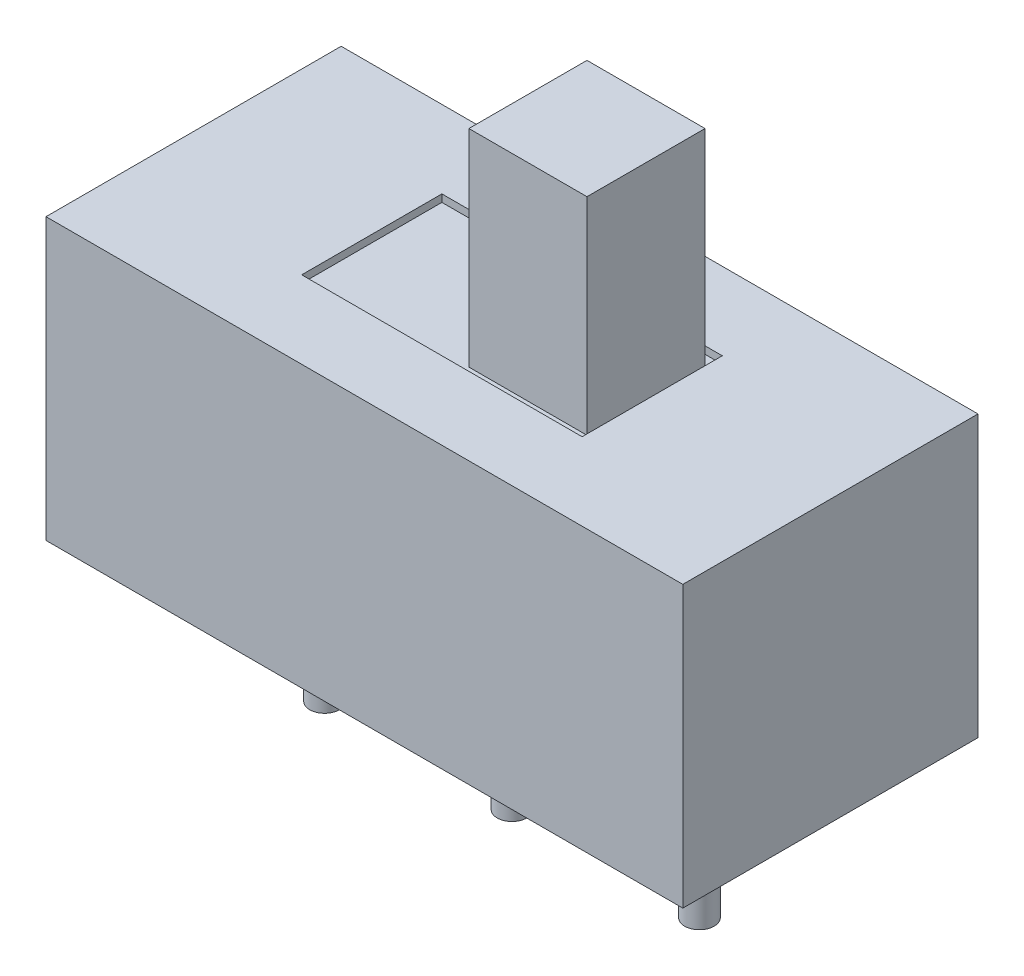
ISO-10303-21;
HEADER;
FILE_DESCRIPTION(('STEP AP214'),'2;1');
FILE_NAME('part.step','',(''),(''),'','','');
FILE_SCHEMA(('AUTOMOTIVE_DESIGN { 1 0 10303 214 1 1 1 1 }'));
ENDSEC;
DATA;
#1=APPLICATION_CONTEXT('core data for automotive mechanical design processes');
#2=APPLICATION_PROTOCOL_DEFINITION('international standard','automotive_design',2000,#1);
#3=PRODUCT_CONTEXT('',#1,'mechanical');
#4=PRODUCT('Part','Part','',(#3));
#5=PRODUCT_RELATED_PRODUCT_CATEGORY('part','',(#4));
#6=PRODUCT_DEFINITION_FORMATION('','',#4);
#7=PRODUCT_DEFINITION_CONTEXT('part definition',#1,'design');
#8=PRODUCT_DEFINITION('design','',#6,#7);
#9=PRODUCT_DEFINITION_SHAPE('','',#8);
#10=(LENGTH_UNIT() NAMED_UNIT(*) SI_UNIT(.MILLI.,.METRE.));
#11=(NAMED_UNIT(*) PLANE_ANGLE_UNIT() SI_UNIT($,.RADIAN.));
#12=(NAMED_UNIT(*) SI_UNIT($,.STERADIAN.) SOLID_ANGLE_UNIT());
#13=UNCERTAINTY_MEASURE_WITH_UNIT(LENGTH_MEASURE(1.E-05),#10,'distance_accuracy_value','');
#14=(GEOMETRIC_REPRESENTATION_CONTEXT(3) GLOBAL_UNCERTAINTY_ASSIGNED_CONTEXT((#13)) GLOBAL_UNIT_ASSIGNED_CONTEXT((#10,
#11,#12)) REPRESENTATION_CONTEXT('',''));
#15=CARTESIAN_POINT('',(0.,0.,0.));
#16=DIRECTION('',(0.,0.,1.));
#17=DIRECTION('',(1.,0.,0.));
#18=AXIS2_PLACEMENT_3D('',#15,#16,#17);
#19=CARTESIAN_POINT('',(0.,3.7,0.));
#20=DIRECTION('',(0.,1.,0.));
#21=DIRECTION('',(0.,0.,1.));
#22=AXIS2_PLACEMENT_3D('',#19,#20,#21);
#23=PLANE('',#22);
#24=DIRECTION('',(0.,0.,-1.));
#25=VECTOR('',#24,1.);
#26=CARTESIAN_POINT('',(1.9,3.7,-0.95));
#27=LINE('',#26,#25);
#28=CARTESIAN_POINT('',(1.9,3.7,0.95));
#29=VERTEX_POINT('',#28);
#30=CARTESIAN_POINT('',(1.9,3.7,-0.95));
#31=VERTEX_POINT('',#30);
#32=EDGE_CURVE('E152',#29,#31,#27,.T.);
#33=ORIENTED_EDGE('',*,*,#32,.T.);
#34=DIRECTION('',(-1.,0.,0.));
#35=VECTOR('',#34,1.);
#36=CARTESIAN_POINT('',(-1.9,3.7,-0.95));
#37=LINE('',#36,#35);
#38=CARTESIAN_POINT('',(-1.9,3.7,-0.95));
#39=VERTEX_POINT('',#38);
#40=EDGE_CURVE('E155',#31,#39,#37,.T.);
#41=ORIENTED_EDGE('',*,*,#40,.T.);
#42=DIRECTION('',(0.,0.,1.));
#43=VECTOR('',#42,1.);
#44=CARTESIAN_POINT('',(-1.9,3.7,-0.95));
#45=LINE('',#44,#43);
#46=CARTESIAN_POINT('',(-1.9,3.7,0.95));
#47=VERTEX_POINT('',#46);
#48=EDGE_CURVE('E159',#39,#47,#45,.T.);
#49=ORIENTED_EDGE('',*,*,#48,.T.);
#50=DIRECTION('',(1.,0.,0.));
#51=VECTOR('',#50,1.);
#52=CARTESIAN_POINT('',(-1.9,3.7,0.95));
#53=LINE('',#52,#51);
#54=EDGE_CURVE('E162',#47,#29,#53,.T.);
#55=ORIENTED_EDGE('',*,*,#54,.T.);
#56=EDGE_LOOP('',(#33,#41,#49,#55));
#57=FACE_BOUND('',#56,.T.);
#58=DIRECTION('',(1.,0.,0.));
#59=VECTOR('',#58,1.);
#60=CARTESIAN_POINT('',(0.215935250156145,3.7,0.8));
#61=LINE('',#60,#59);
#62=CARTESIAN_POINT('',(0.215935250156145,3.7,0.8));
#63=VERTEX_POINT('',#62);
#64=CARTESIAN_POINT('',(1.81593525015615,3.7,0.8));
#65=VERTEX_POINT('',#64);
#66=EDGE_CURVE('E48',#63,#65,#61,.T.);
#67=ORIENTED_EDGE('',*,*,#66,.F.);
#68=DIRECTION('',(0.,0.,1.));
#69=VECTOR('',#68,1.);
#70=CARTESIAN_POINT('',(0.215935250156145,3.7,-0.8));
#71=LINE('',#70,#69);
#72=CARTESIAN_POINT('',(0.215935250156145,3.7,-0.8));
#73=VERTEX_POINT('',#72);
#74=EDGE_CURVE('E143',#73,#63,#71,.T.);
#75=ORIENTED_EDGE('',*,*,#74,.F.);
#76=DIRECTION('',(1.,0.,0.));
#77=VECTOR('',#76,1.);
#78=CARTESIAN_POINT('',(0.215935250156145,3.7,-0.8));
#79=LINE('',#78,#77);
#80=CARTESIAN_POINT('',(1.81593525015614,3.7,-0.8));
#81=VERTEX_POINT('',#80);
#82=EDGE_CURVE('E140',#73,#81,#79,.T.);
#83=ORIENTED_EDGE('',*,*,#82,.T.);
#84=DIRECTION('',(0.,0.,1.));
#85=VECTOR('',#84,1.);
#86=CARTESIAN_POINT('',(1.81593525015614,3.7,-0.8));
#87=LINE('',#86,#85);
#88=EDGE_CURVE('E53',#81,#65,#87,.T.);
#89=ORIENTED_EDGE('',*,*,#88,.T.);
#90=EDGE_LOOP('',(#67,#75,#83,#89));
#91=FACE_BOUND('',#90,.T.);
#92=ADVANCED_FACE('F33',(#57,#91),#23,.T.);
#93=CARTESIAN_POINT('',(4.315,3.8,-2.));
#94=DIRECTION('',(-1.,0.,0.));
#95=DIRECTION('',(0.,0.,1.));
#96=AXIS2_PLACEMENT_3D('',#93,#94,#95);
#97=PLANE('',#96);
#98=DIRECTION('',(0.,0.,-1.));
#99=VECTOR('',#98,1.);
#100=CARTESIAN_POINT('',(4.315,0.,-2.));
#101=LINE('',#100,#99);
#102=CARTESIAN_POINT('',(4.315,0.,2.));
#103=VERTEX_POINT('',#102);
#104=CARTESIAN_POINT('',(4.315,0.,-2.));
#105=VERTEX_POINT('',#104);
#106=EDGE_CURVE('E175',#103,#105,#101,.T.);
#107=ORIENTED_EDGE('',*,*,#106,.T.);
#108=DIRECTION('',(0.,-1.,0.));
#109=VECTOR('',#108,1.);
#110=CARTESIAN_POINT('',(4.315,3.8,-2.));
#111=LINE('',#110,#109);
#112=CARTESIAN_POINT('',(4.315,3.8,-2.));
#113=VERTEX_POINT('',#112);
#114=EDGE_CURVE('E208',#113,#105,#111,.T.);
#115=ORIENTED_EDGE('',*,*,#114,.F.);
#116=DIRECTION('',(0.,0.,-1.));
#117=VECTOR('',#116,1.);
#118=CARTESIAN_POINT('',(4.315,3.8,-2.));
#119=LINE('',#118,#117);
#120=CARTESIAN_POINT('',(4.315,3.8,2.));
#121=VERTEX_POINT('',#120);
#122=EDGE_CURVE('E182',#121,#113,#119,.T.);
#123=ORIENTED_EDGE('',*,*,#122,.F.);
#124=DIRECTION('',(0.,-1.,0.));
#125=VECTOR('',#124,1.);
#126=CARTESIAN_POINT('',(4.315,3.8,2.));
#127=LINE('',#126,#125);
#128=EDGE_CURVE('E192',#121,#103,#127,.T.);
#129=ORIENTED_EDGE('',*,*,#128,.T.);
#130=EDGE_LOOP('',(#107,#115,#123,#129));
#131=FACE_BOUND('',#130,.T.);
#132=ADVANCED_FACE('F35',(#131),#97,.F.);
#133=CARTESIAN_POINT('',(-4.315,3.8,-2.));
#134=DIRECTION('',(0.,0.,1.));
#135=DIRECTION('',(1.,0.,0.));
#136=AXIS2_PLACEMENT_3D('',#133,#134,#135);
#137=PLANE('',#136);
#138=DIRECTION('',(-1.,0.,0.));
#139=VECTOR('',#138,1.);
#140=CARTESIAN_POINT('',(-4.315,0.,-2.));
#141=LINE('',#140,#139);
#142=CARTESIAN_POINT('',(-4.315,0.,-2.));
#143=VERTEX_POINT('',#142);
#144=EDGE_CURVE('E195',#105,#143,#141,.T.);
#145=ORIENTED_EDGE('',*,*,#144,.T.);
#146=DIRECTION('',(0.,-1.,0.));
#147=VECTOR('',#146,1.);
#148=CARTESIAN_POINT('',(-4.315,3.8,-2.));
#149=LINE('',#148,#147);
#150=CARTESIAN_POINT('',(-4.315,3.8,-2.));
#151=VERTEX_POINT('',#150);
#152=EDGE_CURVE('E205',#151,#143,#149,.T.);
#153=ORIENTED_EDGE('',*,*,#152,.F.);
#154=DIRECTION('',(-1.,0.,0.));
#155=VECTOR('',#154,1.);
#156=CARTESIAN_POINT('',(-4.315,3.8,-2.));
#157=LINE('',#156,#155);
#158=EDGE_CURVE('E185',#113,#151,#157,.T.);
#159=ORIENTED_EDGE('',*,*,#158,.F.);
#160=ORIENTED_EDGE('',*,*,#114,.T.);
#161=EDGE_LOOP('',(#145,#153,#159,#160));
#162=FACE_BOUND('',#161,.T.);
#163=ADVANCED_FACE('F243',(#162),#137,.F.);
#164=CARTESIAN_POINT('',(-4.315,3.8,-2.));
#165=DIRECTION('',(1.,0.,0.));
#166=DIRECTION('',(0.,0.,-1.));
#167=AXIS2_PLACEMENT_3D('',#164,#165,#166);
#168=PLANE('',#167);
#169=DIRECTION('',(0.,0.,1.));
#170=VECTOR('',#169,1.);
#171=CARTESIAN_POINT('',(-4.315,0.,-2.));
#172=LINE('',#171,#170);
#173=CARTESIAN_POINT('',(-4.315,0.,2.));
#174=VERTEX_POINT('',#173);
#175=EDGE_CURVE('E197',#143,#174,#172,.T.);
#176=ORIENTED_EDGE('',*,*,#175,.T.);
#177=DIRECTION('',(0.,-1.,0.));
#178=VECTOR('',#177,1.);
#179=CARTESIAN_POINT('',(-4.315,3.8,2.));
#180=LINE('',#179,#178);
#181=CARTESIAN_POINT('',(-4.315,3.8,2.));
#182=VERTEX_POINT('',#181);
#183=EDGE_CURVE('E202',#182,#174,#180,.T.);
#184=ORIENTED_EDGE('',*,*,#183,.F.);
#185=DIRECTION('',(0.,0.,1.));
#186=VECTOR('',#185,1.);
#187=CARTESIAN_POINT('',(-4.315,3.8,-2.));
#188=LINE('',#187,#186);
#189=EDGE_CURVE('E188',#151,#182,#188,.T.);
#190=ORIENTED_EDGE('',*,*,#189,.F.);
#191=ORIENTED_EDGE('',*,*,#152,.T.);
#192=EDGE_LOOP('',(#176,#184,#190,#191));
#193=FACE_BOUND('',#192,.T.);
#194=ADVANCED_FACE('F240',(#193),#168,.F.);
#195=CARTESIAN_POINT('',(-4.315,3.8,2.));
#196=DIRECTION('',(0.,0.,-1.));
#197=DIRECTION('',(-1.,0.,0.));
#198=AXIS2_PLACEMENT_3D('',#195,#196,#197);
#199=PLANE('',#198);
#200=DIRECTION('',(1.,0.,0.));
#201=VECTOR('',#200,1.);
#202=CARTESIAN_POINT('',(-4.315,0.,2.));
#203=LINE('',#202,#201);
#204=EDGE_CURVE('E186',#174,#103,#203,.T.);
#205=ORIENTED_EDGE('',*,*,#204,.T.);
#206=ORIENTED_EDGE('',*,*,#128,.F.);
#207=DIRECTION('',(1.,0.,0.));
#208=VECTOR('',#207,1.);
#209=CARTESIAN_POINT('',(-4.315,3.8,2.));
#210=LINE('',#209,#208);
#211=EDGE_CURVE('E190',#182,#121,#210,.T.);
#212=ORIENTED_EDGE('',*,*,#211,.F.);
#213=ORIENTED_EDGE('',*,*,#183,.T.);
#214=EDGE_LOOP('',(#205,#206,#212,#213));
#215=FACE_BOUND('',#214,.T.);
#216=ADVANCED_FACE('F236',(#215),#199,.F.);
#217=CARTESIAN_POINT('',(0.,3.8,0.));
#218=DIRECTION('',(0.,1.,0.));
#219=DIRECTION('',(0.,0.,1.));
#220=AXIS2_PLACEMENT_3D('',#217,#218,#219);
#221=PLANE('',#220);
#222=DIRECTION('',(0.,0.,-1.));
#223=VECTOR('',#222,1.);
#224=CARTESIAN_POINT('',(1.9,3.8,-0.95));
#225=LINE('',#224,#223);
#226=CARTESIAN_POINT('',(1.9,3.8,0.95));
#227=VERTEX_POINT('',#226);
#228=CARTESIAN_POINT('',(1.9,3.8,-0.95));
#229=VERTEX_POINT('',#228);
#230=EDGE_CURVE('E144',#227,#229,#225,.T.);
#231=ORIENTED_EDGE('',*,*,#230,.F.);
#232=DIRECTION('',(1.,0.,0.));
#233=VECTOR('',#232,1.);
#234=CARTESIAN_POINT('',(-1.9,3.8,0.95));
#235=LINE('',#234,#233);
#236=CARTESIAN_POINT('',(-1.9,3.8,0.95));
#237=VERTEX_POINT('',#236);
#238=EDGE_CURVE('E156',#237,#227,#235,.T.);
#239=ORIENTED_EDGE('',*,*,#238,.F.);
#240=DIRECTION('',(0.,0.,1.));
#241=VECTOR('',#240,1.);
#242=CARTESIAN_POINT('',(-1.9,3.8,-0.95));
#243=LINE('',#242,#241);
#244=CARTESIAN_POINT('',(-1.9,3.8,-0.95));
#245=VERTEX_POINT('',#244);
#246=EDGE_CURVE('E168',#245,#237,#243,.T.);
#247=ORIENTED_EDGE('',*,*,#246,.F.);
#248=DIRECTION('',(-1.,0.,0.));
#249=VECTOR('',#248,1.);
#250=CARTESIAN_POINT('',(-1.9,3.8,-0.95));
#251=LINE('',#250,#249);
#252=EDGE_CURVE('E146',#229,#245,#251,.T.);
#253=ORIENTED_EDGE('',*,*,#252,.F.);
#254=EDGE_LOOP('',(#231,#239,#247,#253));
#255=FACE_BOUND('',#254,.T.);
#256=ORIENTED_EDGE('',*,*,#122,.T.);
#257=ORIENTED_EDGE('',*,*,#158,.T.);
#258=ORIENTED_EDGE('',*,*,#189,.T.);
#259=ORIENTED_EDGE('',*,*,#211,.T.);
#260=EDGE_LOOP('',(#256,#257,#258,#259));
#261=FACE_BOUND('',#260,.T.);
#262=ADVANCED_FACE('F222',(#255,#261),#221,.T.);
#263=CARTESIAN_POINT('',(0.,0.,0.));
#264=DIRECTION('',(0.,1.,0.));
#265=DIRECTION('',(0.,0.,1.));
#266=AXIS2_PLACEMENT_3D('',#263,#264,#265);
#267=PLANE('',#266);
#268=CARTESIAN_POINT('',(2.54,0.,0.));
#269=DIRECTION('',(0.,1.,0.));
#270=DIRECTION('',(0.,0.,1.));
#271=AXIS2_PLACEMENT_3D('',#268,#269,#270);
#272=CIRCLE('',#271,0.2);
#273=CARTESIAN_POINT('',(2.54,0.,0.2));
#274=VERTEX_POINT('',#273);
#275=EDGE_CURVE('E11',#274,#274,#272,.F.);
#276=ORIENTED_EDGE('',*,*,#275,.F.);
#277=EDGE_LOOP('',(#276));
#278=FACE_BOUND('',#277,.T.);
#279=CARTESIAN_POINT('',(0.,0.,0.));
#280=DIRECTION('',(0.,1.,0.));
#281=DIRECTION('',(0.,0.,1.));
#282=AXIS2_PLACEMENT_3D('',#279,#280,#281);
#283=CIRCLE('',#282,0.2);
#284=CARTESIAN_POINT('',(0.,0.,0.2));
#285=VERTEX_POINT('',#284);
#286=EDGE_CURVE('E41',#285,#285,#283,.F.);
#287=ORIENTED_EDGE('',*,*,#286,.F.);
#288=EDGE_LOOP('',(#287));
#289=FACE_BOUND('',#288,.T.);
#290=CARTESIAN_POINT('',(-2.54,0.,0.));
#291=DIRECTION('',(0.,1.,0.));
#292=DIRECTION('',(0.,0.,1.));
#293=AXIS2_PLACEMENT_3D('',#290,#291,#292);
#294=CIRCLE('',#293,0.2);
#295=CARTESIAN_POINT('',(-2.54,0.,0.2));
#296=VERTEX_POINT('',#295);
#297=EDGE_CURVE('E211',#296,#296,#294,.F.);
#298=ORIENTED_EDGE('',*,*,#297,.F.);
#299=EDGE_LOOP('',(#298));
#300=FACE_BOUND('',#299,.T.);
#301=ORIENTED_EDGE('',*,*,#106,.F.);
#302=ORIENTED_EDGE('',*,*,#204,.F.);
#303=ORIENTED_EDGE('',*,*,#175,.F.);
#304=ORIENTED_EDGE('',*,*,#144,.F.);
#305=EDGE_LOOP('',(#301,#302,#303,#304));
#306=FACE_BOUND('',#305,.T.);
#307=ADVANCED_FACE('F218',(#278,#289,#300,#306),#267,.F.);
#308=CARTESIAN_POINT('',(1.9,3.7,-0.95));
#309=DIRECTION('',(1.,0.,0.));
#310=DIRECTION('',(0.,0.,-1.));
#311=AXIS2_PLACEMENT_3D('',#308,#309,#310);
#312=PLANE('',#311);
#313=ORIENTED_EDGE('',*,*,#230,.T.);
#314=DIRECTION('',(0.,1.,0.));
#315=VECTOR('',#314,1.);
#316=CARTESIAN_POINT('',(1.9,3.7,-0.95));
#317=LINE('',#316,#315);
#318=EDGE_CURVE('E164',#31,#229,#317,.T.);
#319=ORIENTED_EDGE('',*,*,#318,.F.);
#320=ORIENTED_EDGE('',*,*,#32,.F.);
#321=DIRECTION('',(0.,1.,0.));
#322=VECTOR('',#321,1.);
#323=CARTESIAN_POINT('',(1.9,3.7,0.95));
#324=LINE('',#323,#322);
#325=EDGE_CURVE('E173',#29,#227,#324,.T.);
#326=ORIENTED_EDGE('',*,*,#325,.T.);
#327=EDGE_LOOP('',(#313,#319,#320,#326));
#328=FACE_BOUND('',#327,.T.);
#329=ADVANCED_FACE('F221',(#328),#312,.F.);
#330=CARTESIAN_POINT('',(-1.9,3.7,0.95));
#331=DIRECTION('',(0.,0.,1.));
#332=DIRECTION('',(1.,0.,0.));
#333=AXIS2_PLACEMENT_3D('',#330,#331,#332);
#334=PLANE('',#333);
#335=ORIENTED_EDGE('',*,*,#238,.T.);
#336=ORIENTED_EDGE('',*,*,#325,.F.);
#337=ORIENTED_EDGE('',*,*,#54,.F.);
#338=DIRECTION('',(0.,1.,0.));
#339=VECTOR('',#338,1.);
#340=CARTESIAN_POINT('',(-1.9,3.7,0.95));
#341=LINE('',#340,#339);
#342=EDGE_CURVE('E176',#47,#237,#341,.T.);
#343=ORIENTED_EDGE('',*,*,#342,.T.);
#344=EDGE_LOOP('',(#335,#336,#337,#343));
#345=FACE_BOUND('',#344,.T.);
#346=ADVANCED_FACE('F263',(#345),#334,.F.);
#347=CARTESIAN_POINT('',(-1.9,3.7,-0.95));
#348=DIRECTION('',(-1.,0.,0.));
#349=DIRECTION('',(0.,0.,1.));
#350=AXIS2_PLACEMENT_3D('',#347,#348,#349);
#351=PLANE('',#350);
#352=ORIENTED_EDGE('',*,*,#246,.T.);
#353=ORIENTED_EDGE('',*,*,#342,.F.);
#354=ORIENTED_EDGE('',*,*,#48,.F.);
#355=DIRECTION('',(0.,1.,0.));
#356=VECTOR('',#355,1.);
#357=CARTESIAN_POINT('',(-1.9,3.7,-0.95));
#358=LINE('',#357,#356);
#359=EDGE_CURVE('E178',#39,#245,#358,.T.);
#360=ORIENTED_EDGE('',*,*,#359,.T.);
#361=EDGE_LOOP('',(#352,#353,#354,#360));
#362=FACE_BOUND('',#361,.T.);
#363=ADVANCED_FACE('F266',(#362),#351,.F.);
#364=CARTESIAN_POINT('',(-1.9,3.7,-0.95));
#365=DIRECTION('',(0.,0.,-1.));
#366=DIRECTION('',(-1.,0.,0.));
#367=AXIS2_PLACEMENT_3D('',#364,#365,#366);
#368=PLANE('',#367);
#369=ORIENTED_EDGE('',*,*,#252,.T.);
#370=ORIENTED_EDGE('',*,*,#359,.F.);
#371=ORIENTED_EDGE('',*,*,#40,.F.);
#372=ORIENTED_EDGE('',*,*,#318,.T.);
#373=EDGE_LOOP('',(#369,#370,#371,#372));
#374=FACE_BOUND('',#373,.T.);
#375=ADVANCED_FACE('F270',(#374),#368,.F.);
#376=CARTESIAN_POINT('',(0.215935250156145,6.5,-0.8));
#377=DIRECTION('',(1.,0.,0.));
#378=DIRECTION('',(0.,0.,-1.));
#379=AXIS2_PLACEMENT_3D('',#376,#377,#378);
#380=PLANE('',#379);
#381=ORIENTED_EDGE('',*,*,#74,.T.);
#382=DIRECTION('',(0.,-1.,0.));
#383=VECTOR('',#382,1.);
#384=CARTESIAN_POINT('',(0.215935250156145,6.5,0.8));
#385=LINE('',#384,#383);
#386=CARTESIAN_POINT('',(0.215935250156145,6.5,0.8));
#387=VERTEX_POINT('',#386);
#388=EDGE_CURVE('E124',#387,#63,#385,.T.);
#389=ORIENTED_EDGE('',*,*,#388,.F.);
#390=DIRECTION('',(0.,0.,1.));
#391=VECTOR('',#390,1.);
#392=CARTESIAN_POINT('',(0.215935250156145,6.5,-0.8));
#393=LINE('',#392,#391);
#394=CARTESIAN_POINT('',(0.215935250156145,6.5,-0.8));
#395=VERTEX_POINT('',#394);
#396=EDGE_CURVE('E131',#395,#387,#393,.T.);
#397=ORIENTED_EDGE('',*,*,#396,.F.);
#398=DIRECTION('',(0.,-1.,0.));
#399=VECTOR('',#398,1.);
#400=CARTESIAN_POINT('',(0.215935250156145,6.5,-0.8));
#401=LINE('',#400,#399);
#402=EDGE_CURVE('E462',#395,#73,#401,.T.);
#403=ORIENTED_EDGE('',*,*,#402,.T.);
#404=EDGE_LOOP('',(#381,#389,#397,#403));
#405=FACE_BOUND('',#404,.T.);
#406=ADVANCED_FACE('F142',(#405),#380,.F.);
#407=CARTESIAN_POINT('',(0.215935250156145,6.5,0.8));
#408=DIRECTION('',(0.,0.,-1.));
#409=DIRECTION('',(-1.,0.,0.));
#410=AXIS2_PLACEMENT_3D('',#407,#408,#409);
#411=PLANE('',#410);
#412=ORIENTED_EDGE('',*,*,#66,.T.);
#413=DIRECTION('',(0.,-1.,0.));
#414=VECTOR('',#413,1.);
#415=CARTESIAN_POINT('',(1.81593525015615,6.5,0.8));
#416=LINE('',#415,#414);
#417=CARTESIAN_POINT('',(1.81593525015615,6.5,0.8));
#418=VERTEX_POINT('',#417);
#419=EDGE_CURVE('E126',#418,#65,#416,.T.);
#420=ORIENTED_EDGE('',*,*,#419,.F.);
#421=DIRECTION('',(1.,0.,0.));
#422=VECTOR('',#421,1.);
#423=CARTESIAN_POINT('',(0.215935250156145,6.5,0.8));
#424=LINE('',#423,#422);
#425=EDGE_CURVE('E120',#387,#418,#424,.T.);
#426=ORIENTED_EDGE('',*,*,#425,.F.);
#427=ORIENTED_EDGE('',*,*,#388,.T.);
#428=EDGE_LOOP('',(#412,#420,#426,#427));
#429=FACE_BOUND('',#428,.T.);
#430=ADVANCED_FACE('F122',(#429),#411,.F.);
#431=CARTESIAN_POINT('',(1.81593525015614,6.5,-0.8));
#432=DIRECTION('',(1.,0.,0.));
#433=DIRECTION('',(0.,0.,-1.));
#434=AXIS2_PLACEMENT_3D('',#431,#432,#433);
#435=PLANE('',#434);
#436=ORIENTED_EDGE('',*,*,#88,.F.);
#437=DIRECTION('',(0.,-1.,0.));
#438=VECTOR('',#437,1.);
#439=CARTESIAN_POINT('',(1.81593525015614,6.5,-0.8));
#440=LINE('',#439,#438);
#441=CARTESIAN_POINT('',(1.81593525015614,6.5,-0.8));
#442=VERTEX_POINT('',#441);
#443=EDGE_CURVE('E148',#442,#81,#440,.T.);
#444=ORIENTED_EDGE('',*,*,#443,.F.);
#445=DIRECTION('',(0.,0.,1.));
#446=VECTOR('',#445,1.);
#447=CARTESIAN_POINT('',(1.81593525015614,6.5,-0.8));
#448=LINE('',#447,#446);
#449=EDGE_CURVE('E130',#442,#418,#448,.T.);
#450=ORIENTED_EDGE('',*,*,#449,.T.);
#451=ORIENTED_EDGE('',*,*,#419,.T.);
#452=EDGE_LOOP('',(#436,#444,#450,#451));
#453=FACE_BOUND('',#452,.T.);
#454=ADVANCED_FACE('F310',(#453),#435,.T.);
#455=CARTESIAN_POINT('',(0.215935250156145,6.5,-0.8));
#456=DIRECTION('',(0.,0.,-1.));
#457=DIRECTION('',(-1.,0.,0.));
#458=AXIS2_PLACEMENT_3D('',#455,#456,#457);
#459=PLANE('',#458);
#460=ORIENTED_EDGE('',*,*,#82,.F.);
#461=ORIENTED_EDGE('',*,*,#402,.F.);
#462=DIRECTION('',(1.,0.,0.));
#463=VECTOR('',#462,1.);
#464=CARTESIAN_POINT('',(0.215935250156145,6.5,-0.8));
#465=LINE('',#464,#463);
#466=EDGE_CURVE('E137',#395,#442,#465,.T.);
#467=ORIENTED_EDGE('',*,*,#466,.T.);
#468=ORIENTED_EDGE('',*,*,#443,.T.);
#469=EDGE_LOOP('',(#460,#461,#467,#468));
#470=FACE_BOUND('',#469,.T.);
#471=ADVANCED_FACE('F316',(#470),#459,.T.);
#472=CARTESIAN_POINT('',(0.,6.5,0.));
#473=DIRECTION('',(0.,1.,0.));
#474=DIRECTION('',(0.,0.,1.));
#475=AXIS2_PLACEMENT_3D('',#472,#473,#474);
#476=PLANE('',#475);
#477=ORIENTED_EDGE('',*,*,#396,.T.);
#478=ORIENTED_EDGE('',*,*,#425,.T.);
#479=ORIENTED_EDGE('',*,*,#449,.F.);
#480=ORIENTED_EDGE('',*,*,#466,.F.);
#481=EDGE_LOOP('',(#477,#478,#479,#480));
#482=FACE_BOUND('',#481,.T.);
#483=ADVANCED_FACE('F135',(#482),#476,.T.);
#484=CARTESIAN_POINT('',(-2.54,-2.,0.));
#485=DIRECTION('',(0.,1.,0.));
#486=DIRECTION('',(0.,0.,1.));
#487=AXIS2_PLACEMENT_3D('',#484,#485,#486);
#488=CYLINDRICAL_SURFACE('',#487,0.2);
#489=CARTESIAN_POINT('',(-2.54,-2.,0.));
#490=DIRECTION('',(0.,-1.,0.));
#491=DIRECTION('',(0.,0.,-1.));
#492=AXIS2_PLACEMENT_3D('',#489,#490,#491);
#493=CIRCLE('',#492,0.2);
#494=CARTESIAN_POINT('',(-2.54,-2.,-0.200000000000001));
#495=VERTEX_POINT('',#494);
#496=EDGE_CURVE('E455',#495,#495,#493,.T.);
#497=ORIENTED_EDGE('',*,*,#496,.F.);
#498=EDGE_LOOP('',(#497));
#499=FACE_BOUND('',#498,.T.);
#500=ORIENTED_EDGE('',*,*,#297,.T.);
#501=EDGE_LOOP('',(#500));
#502=FACE_BOUND('',#501,.T.);
#503=ADVANCED_FACE('F331',(#499,#502),#488,.T.);
#504=CARTESIAN_POINT('',(-2.54,-2.,0.));
#505=DIRECTION('',(0.,-1.,0.));
#506=DIRECTION('',(0.,0.,-1.));
#507=AXIS2_PLACEMENT_3D('',#504,#505,#506);
#508=PLANE('',#507);
#509=ORIENTED_EDGE('',*,*,#496,.T.);
#510=EDGE_LOOP('',(#509));
#511=FACE_BOUND('',#510,.T.);
#512=ADVANCED_FACE('F338',(#511),#508,.T.);
#513=CARTESIAN_POINT('',(0.,-2.,0.));
#514=DIRECTION('',(0.,1.,0.));
#515=DIRECTION('',(0.,0.,1.));
#516=AXIS2_PLACEMENT_3D('',#513,#514,#515);
#517=CYLINDRICAL_SURFACE('',#516,0.2);
#518=CARTESIAN_POINT('',(0.,-2.,0.));
#519=DIRECTION('',(0.,-1.,0.));
#520=DIRECTION('',(0.,0.,-1.));
#521=AXIS2_PLACEMENT_3D('',#518,#519,#520);
#522=CIRCLE('',#521,0.2);
#523=CARTESIAN_POINT('',(0.,-2.,-0.2));
#524=VERTEX_POINT('',#523);
#525=EDGE_CURVE('E452',#524,#524,#522,.T.);
#526=ORIENTED_EDGE('',*,*,#525,.F.);
#527=EDGE_LOOP('',(#526));
#528=FACE_BOUND('',#527,.T.);
#529=ORIENTED_EDGE('',*,*,#286,.T.);
#530=EDGE_LOOP('',(#529));
#531=FACE_BOUND('',#530,.T.);
#532=ADVANCED_FACE('F216',(#528,#531),#517,.T.);
#533=CARTESIAN_POINT('',(0.,-2.,0.));
#534=DIRECTION('',(0.,-1.,0.));
#535=DIRECTION('',(0.,0.,-1.));
#536=AXIS2_PLACEMENT_3D('',#533,#534,#535);
#537=PLANE('',#536);
#538=ORIENTED_EDGE('',*,*,#525,.T.);
#539=EDGE_LOOP('',(#538));
#540=FACE_BOUND('',#539,.T.);
#541=ADVANCED_FACE('F353',(#540),#537,.T.);
#542=CARTESIAN_POINT('',(2.54,-2.,0.));
#543=DIRECTION('',(0.,1.,0.));
#544=DIRECTION('',(0.,0.,1.));
#545=AXIS2_PLACEMENT_3D('',#542,#543,#544);
#546=CYLINDRICAL_SURFACE('',#545,0.2);
#547=CARTESIAN_POINT('',(2.54,-2.,0.));
#548=DIRECTION('',(0.,-1.,0.));
#549=DIRECTION('',(0.,0.,-1.));
#550=AXIS2_PLACEMENT_3D('',#547,#548,#549);
#551=CIRCLE('',#550,0.2);
#552=CARTESIAN_POINT('',(2.54,-2.,-0.200000000000001));
#553=VERTEX_POINT('',#552);
#554=EDGE_CURVE('E451',#553,#553,#551,.T.);
#555=ORIENTED_EDGE('',*,*,#554,.F.);
#556=EDGE_LOOP('',(#555));
#557=FACE_BOUND('',#556,.T.);
#558=ORIENTED_EDGE('',*,*,#275,.T.);
#559=EDGE_LOOP('',(#558));
#560=FACE_BOUND('',#559,.T.);
#561=ADVANCED_FACE('F361',(#557,#560),#546,.T.);
#562=CARTESIAN_POINT('',(2.54,-2.,0.));
#563=DIRECTION('',(0.,-1.,0.));
#564=DIRECTION('',(0.,0.,-1.));
#565=AXIS2_PLACEMENT_3D('',#562,#563,#564);
#566=PLANE('',#565);
#567=ORIENTED_EDGE('',*,*,#554,.T.);
#568=EDGE_LOOP('',(#567));
#569=FACE_BOUND('',#568,.T.);
#570=ADVANCED_FACE('F369',(#569),#566,.T.);
#571=CLOSED_SHELL('',(#92,#132,#163,#194,#216,#262,#307,#329,#346,#363,#375,#406,#430,#454,#471,
#483,#503,#512,#532,#541,#561,#570));
#572=MANIFOLD_SOLID_BREP('B2',#571);
#573=ADVANCED_BREP_SHAPE_REPRESENTATION('',(#18,#572),#14);
#574=SHAPE_DEFINITION_REPRESENTATION(#9,#573);
ENDSEC;
END-ISO-10303-21;
